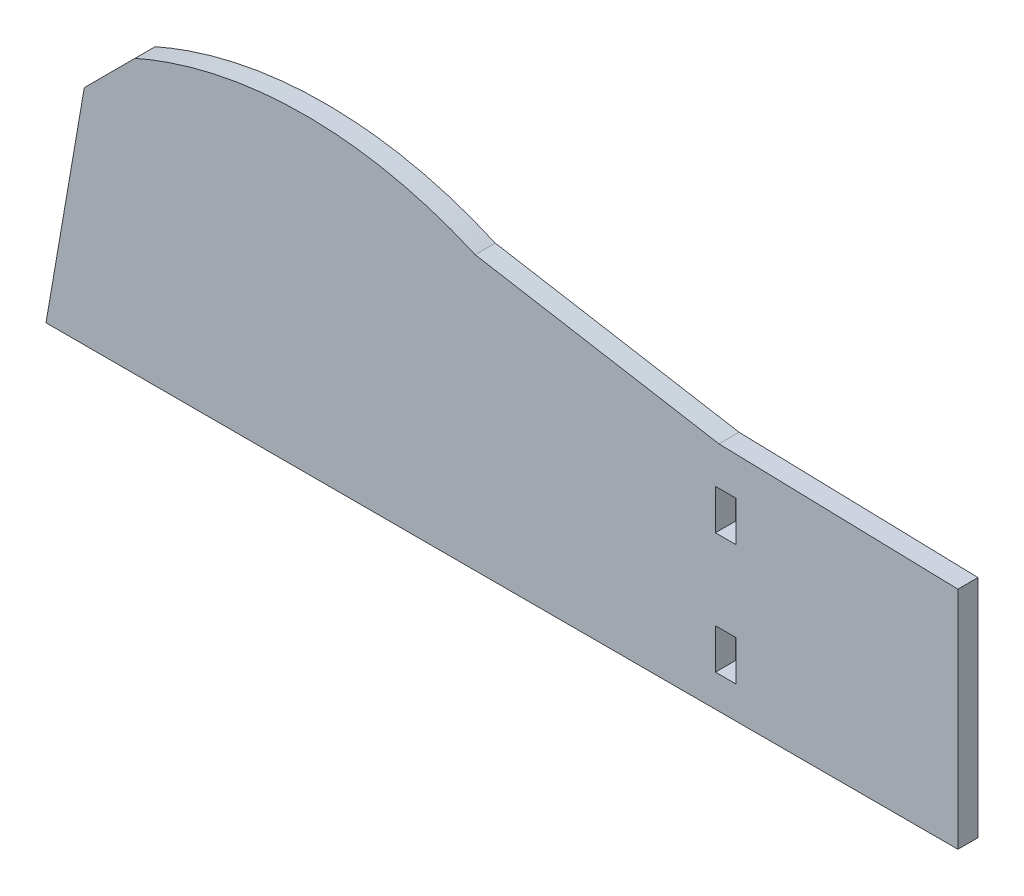
ISO-10303-21;
HEADER;
FILE_DESCRIPTION(('STEP AP214'),'2;1');
FILE_NAME('part.step','',(''),(''),'','','');
FILE_SCHEMA(('AUTOMOTIVE_DESIGN { 1 0 10303 214 1 1 1 1 }'));
ENDSEC;
DATA;
#1=APPLICATION_CONTEXT('core data for automotive mechanical design processes');
#2=APPLICATION_PROTOCOL_DEFINITION('international standard','automotive_design',2000,#1);
#3=PRODUCT_CONTEXT('',#1,'mechanical');
#4=PRODUCT('Part','Part','',(#3));
#5=PRODUCT_RELATED_PRODUCT_CATEGORY('part','',(#4));
#6=PRODUCT_DEFINITION_FORMATION('','',#4);
#7=PRODUCT_DEFINITION_CONTEXT('part definition',#1,'design');
#8=PRODUCT_DEFINITION('design','',#6,#7);
#9=PRODUCT_DEFINITION_SHAPE('','',#8);
#10=(LENGTH_UNIT() NAMED_UNIT(*) SI_UNIT(.MILLI.,.METRE.));
#11=(NAMED_UNIT(*) PLANE_ANGLE_UNIT() SI_UNIT($,.RADIAN.));
#12=(NAMED_UNIT(*) SI_UNIT($,.STERADIAN.) SOLID_ANGLE_UNIT());
#13=UNCERTAINTY_MEASURE_WITH_UNIT(LENGTH_MEASURE(1.E-05),#10,'distance_accuracy_value','');
#14=(GEOMETRIC_REPRESENTATION_CONTEXT(3) GLOBAL_UNCERTAINTY_ASSIGNED_CONTEXT((#13)) GLOBAL_UNIT_ASSIGNED_CONTEXT((#10,
#11,#12)) REPRESENTATION_CONTEXT('',''));
#15=CARTESIAN_POINT('',(0.,0.,0.));
#16=DIRECTION('',(0.,0.,1.));
#17=DIRECTION('',(1.,0.,0.));
#18=AXIS2_PLACEMENT_3D('',#15,#16,#17);
#19=CARTESIAN_POINT('',(0.,35.56,3.175));
#20=DIRECTION('',(-1.,0.,0.));
#21=DIRECTION('',(0.,-1.,0.));
#22=AXIS2_PLACEMENT_3D('',#19,#20,#21);
#23=PLANE('',#22);
#24=DIRECTION('',(0.,1.,0.));
#25=VECTOR('',#24,1.);
#26=CARTESIAN_POINT('',(0.,35.56,0.));
#27=LINE('',#26,#25);
#28=CARTESIAN_POINT('',(0.,0.,0.));
#29=VERTEX_POINT('',#28);
#30=CARTESIAN_POINT('',(0.,35.56,0.));
#31=VERTEX_POINT('',#30);
#32=EDGE_CURVE('E201',#29,#31,#27,.T.);
#33=ORIENTED_EDGE('',*,*,#32,.T.);
#34=DIRECTION('',(0.,0.,-1.));
#35=VECTOR('',#34,1.);
#36=CARTESIAN_POINT('',(0.,35.56,3.175));
#37=LINE('',#36,#35);
#38=CARTESIAN_POINT('',(0.,35.56,3.175));
#39=VERTEX_POINT('',#38);
#40=EDGE_CURVE('E11',#39,#31,#37,.T.);
#41=ORIENTED_EDGE('',*,*,#40,.F.);
#42=DIRECTION('',(0.,1.,0.));
#43=VECTOR('',#42,1.);
#44=CARTESIAN_POINT('',(0.,35.56,3.175));
#45=LINE('',#44,#43);
#46=CARTESIAN_POINT('',(0.,0.,3.175));
#47=VERTEX_POINT('',#46);
#48=EDGE_CURVE('E208',#47,#39,#45,.T.);
#49=ORIENTED_EDGE('',*,*,#48,.F.);
#50=DIRECTION('',(0.,0.,-1.));
#51=VECTOR('',#50,1.);
#52=CARTESIAN_POINT('',(0.,0.,3.175));
#53=LINE('',#52,#51);
#54=EDGE_CURVE('E275',#47,#29,#53,.T.);
#55=ORIENTED_EDGE('',*,*,#54,.T.);
#56=EDGE_LOOP('',(#33,#41,#49,#55));
#57=FACE_BOUND('',#56,.T.);
#58=ADVANCED_FACE('F33',(#57),#23,.F.);
#59=CARTESIAN_POINT('',(-37.7133554514035,36.5669249604453,3.175));
#60=DIRECTION('',(-0.0266899150769853,-0.999643760763395,0.));
#61=DIRECTION('',(0.999643760763395,-0.0266899150769853,0.));
#62=AXIS2_PLACEMENT_3D('',#59,#60,#61);
#63=PLANE('',#62);
#64=DIRECTION('',(-0.999643760763395,0.0266899150769853,0.));
#65=VECTOR('',#64,1.);
#66=CARTESIAN_POINT('',(-37.7133554514035,36.5669249604453,0.));
#67=LINE('',#66,#65);
#68=CARTESIAN_POINT('',(-37.7133554514035,36.5669249604453,0.));
#69=VERTEX_POINT('',#68);
#70=EDGE_CURVE('E245',#31,#69,#67,.T.);
#71=ORIENTED_EDGE('',*,*,#70,.T.);
#72=DIRECTION('',(0.,0.,-1.));
#73=VECTOR('',#72,1.);
#74=CARTESIAN_POINT('',(-37.7133554514035,36.5669249604453,3.175));
#75=LINE('',#74,#73);
#76=CARTESIAN_POINT('',(-37.7133554514035,36.5669249604453,3.175));
#77=VERTEX_POINT('',#76);
#78=EDGE_CURVE('E40',#77,#69,#75,.T.);
#79=ORIENTED_EDGE('',*,*,#78,.F.);
#80=DIRECTION('',(-0.999643760763395,0.0266899150769853,0.));
#81=VECTOR('',#80,1.);
#82=CARTESIAN_POINT('',(-37.7133554514035,36.5669249604453,3.175));
#83=LINE('',#82,#81);
#84=EDGE_CURVE('E211',#39,#77,#83,.T.);
#85=ORIENTED_EDGE('',*,*,#84,.F.);
#86=ORIENTED_EDGE('',*,*,#40,.T.);
#87=EDGE_LOOP('',(#71,#79,#85,#86));
#88=FACE_BOUND('',#87,.T.);
#89=ADVANCED_FACE('F236',(#88),#63,.F.);
#90=CARTESIAN_POINT('',(-76.2,43.18,3.175));
#91=DIRECTION('',(-0.169346021402063,-0.985556657445574,0.));
#92=DIRECTION('',(0.985556657445574,-0.169346021402064,0.));
#93=AXIS2_PLACEMENT_3D('',#90,#91,#92);
#94=PLANE('',#93);
#95=DIRECTION('',(-0.985556657445574,0.169346021402063,0.));
#96=VECTOR('',#95,1.);
#97=CARTESIAN_POINT('',(-76.2,43.18,0.));
#98=LINE('',#97,#96);
#99=CARTESIAN_POINT('',(-76.2,43.18,0.));
#100=VERTEX_POINT('',#99);
#101=EDGE_CURVE('E253',#69,#100,#98,.T.);
#102=ORIENTED_EDGE('',*,*,#101,.T.);
#103=DIRECTION('',(0.,0.,-1.));
#104=VECTOR('',#103,1.);
#105=CARTESIAN_POINT('',(-76.2,43.18,3.175));
#106=LINE('',#105,#104);
#107=CARTESIAN_POINT('',(-76.2,43.18,3.175));
#108=VERTEX_POINT('',#107);
#109=EDGE_CURVE('E257',#108,#100,#106,.T.);
#110=ORIENTED_EDGE('',*,*,#109,.F.);
#111=DIRECTION('',(-0.985556657445574,0.169346021402063,0.));
#112=VECTOR('',#111,1.);
#113=CARTESIAN_POINT('',(-76.2,43.18,3.175));
#114=LINE('',#113,#112);
#115=EDGE_CURVE('E214',#77,#108,#114,.T.);
#116=ORIENTED_EDGE('',*,*,#115,.F.);
#117=ORIENTED_EDGE('',*,*,#78,.T.);
#118=EDGE_LOOP('',(#102,#110,#116,#117));
#119=FACE_BOUND('',#118,.T.);
#120=ADVANCED_FACE('F232',(#119),#94,.F.);
#121=CARTESIAN_POINT('',(-76.2,43.18,3.175));
#122=CARTESIAN_POINT('',(-79.7260587717616,44.7408164594273,3.175));
#123=CARTESIAN_POINT('',(-86.4115426594005,47.0274632286595,3.175));
#124=CARTESIAN_POINT('',(-95.5225011340299,48.5934208601401,3.175));
#125=CARTESIAN_POINT('',(-103.247996655704,48.9721366914077,3.175));
#126=CARTESIAN_POINT('',(-114.625709488405,48.3623172431234,3.175));
#127=CARTESIAN_POINT('',(-123.63290929377,45.9559869162211,3.175));
#128=CARTESIAN_POINT('',(-129.892439684021,43.18,3.175));
#129=B_SPLINE_CURVE_WITH_KNOTS('',3,(#121,#122,#123,#124,#125,#126,#127,#128),.UNSPECIFIED.,.F.,
.F.,(4,1,1,1,1,4),(0.,0.209285503080936,0.382391471797348,0.500093059641283,0.628767459079232,
1.),.UNSPECIFIED.);
#130=DIRECTION('',(0.,0.,-1.));
#131=VECTOR('',#130,1.);
#132=SURFACE_OF_LINEAR_EXTRUSION('',#129,#131);
#133=CARTESIAN_POINT('',(-76.2,43.18,0.));
#134=CARTESIAN_POINT('',(-79.7260587717616,44.7408164594273,0.));
#135=CARTESIAN_POINT('',(-86.4115426594005,47.0274632286595,0.));
#136=CARTESIAN_POINT('',(-95.5225011340299,48.5934208601401,0.));
#137=CARTESIAN_POINT('',(-103.247996655704,48.9721366914077,0.));
#138=CARTESIAN_POINT('',(-114.625709488405,48.3623172431234,0.));
#139=CARTESIAN_POINT('',(-123.63290929377,45.9559869162211,0.));
#140=CARTESIAN_POINT('',(-129.892439684021,43.18,0.));
#141=B_SPLINE_CURVE_WITH_KNOTS('',3,(#133,#134,#135,#136,#137,#138,#139,#140),.UNSPECIFIED.,.F.,
.F.,(4,1,1,1,1,4),(0.,0.209285503080936,0.382391471797348,0.500093059641283,0.628767459079232,
1.),.UNSPECIFIED.);
#142=CARTESIAN_POINT('',(-129.892439684021,43.18,0.));
#143=VERTEX_POINT('',#142);
#144=EDGE_CURVE('E260',#100,#143,#141,.T.);
#145=ORIENTED_EDGE('',*,*,#144,.T.);
#146=DIRECTION('',(0.,0.,-1.));
#147=VECTOR('',#146,1.);
#148=CARTESIAN_POINT('',(-129.892439684021,43.18,3.175));
#149=LINE('',#148,#147);
#150=CARTESIAN_POINT('',(-129.892439684021,43.18,3.175));
#151=VERTEX_POINT('',#150);
#152=EDGE_CURVE('E285',#151,#143,#149,.T.);
#153=ORIENTED_EDGE('',*,*,#152,.F.);
#154=EDGE_CURVE('E216',#108,#151,#129,.T.);
#155=ORIENTED_EDGE('',*,*,#154,.F.);
#156=ORIENTED_EDGE('',*,*,#109,.T.);
#157=EDGE_LOOP('',(#145,#153,#155,#156));
#158=FACE_BOUND('',#157,.T.);
#159=ADVANCED_FACE('F227',(#158),#132,.F.);
#160=CARTESIAN_POINT('',(-129.892439684021,43.18,3.175));
#161=DIRECTION('',(0.707106781186548,-0.707106781186547,0.));
#162=DIRECTION('',(0.707106781186547,0.707106781186548,0.));
#163=AXIS2_PLACEMENT_3D('',#160,#161,#162);
#164=PLANE('',#163);
#165=DIRECTION('',(-0.707106781186547,-0.707106781186548,0.));
#166=VECTOR('',#165,1.);
#167=CARTESIAN_POINT('',(-129.892439684021,43.18,0.));
#168=LINE('',#167,#166);
#169=CARTESIAN_POINT('',(-137.89580793114,35.1766317528806,0.));
#170=VERTEX_POINT('',#169);
#171=EDGE_CURVE('E262',#143,#170,#168,.T.);
#172=ORIENTED_EDGE('',*,*,#171,.T.);
#173=DIRECTION('',(0.,0.,-1.));
#174=VECTOR('',#173,1.);
#175=CARTESIAN_POINT('',(-137.89580793114,35.1766317528806,3.175));
#176=LINE('',#175,#174);
#177=CARTESIAN_POINT('',(-137.89580793114,35.1766317528806,3.175));
#178=VERTEX_POINT('',#177);
#179=EDGE_CURVE('E282',#178,#170,#176,.T.);
#180=ORIENTED_EDGE('',*,*,#179,.F.);
#181=DIRECTION('',(-0.707106781186547,-0.707106781186548,0.));
#182=VECTOR('',#181,1.);
#183=CARTESIAN_POINT('',(-129.892439684021,43.18,3.175));
#184=LINE('',#183,#182);
#185=EDGE_CURVE('E221',#151,#178,#184,.T.);
#186=ORIENTED_EDGE('',*,*,#185,.F.);
#187=ORIENTED_EDGE('',*,*,#152,.T.);
#188=EDGE_LOOP('',(#172,#180,#186,#187));
#189=FACE_BOUND('',#188,.T.);
#190=ADVANCED_FACE('F231',(#189),#164,.F.);
#191=CARTESIAN_POINT('',(-137.89580793114,35.1766317528806,3.175));
#192=DIRECTION('',(0.985556657445574,-0.169346021402064,0.));
#193=DIRECTION('',(0.169346021402064,0.985556657445574,0.));
#194=AXIS2_PLACEMENT_3D('',#191,#192,#193);
#195=PLANE('',#194);
#196=DIRECTION('',(-0.169346021402064,-0.985556657445573,0.));
#197=VECTOR('',#196,1.);
#198=CARTESIAN_POINT('',(-137.89580793114,35.1766317528806,0.));
#199=LINE('',#198,#197);
#200=CARTESIAN_POINT('',(-143.940130790382,0.,0.));
#201=VERTEX_POINT('',#200);
#202=EDGE_CURVE('E272',#170,#201,#199,.T.);
#203=ORIENTED_EDGE('',*,*,#202,.T.);
#204=DIRECTION('',(0.,0.,-1.));
#205=VECTOR('',#204,1.);
#206=CARTESIAN_POINT('',(-143.940130790382,0.,3.175));
#207=LINE('',#206,#205);
#208=CARTESIAN_POINT('',(-143.940130790382,0.,3.175));
#209=VERTEX_POINT('',#208);
#210=EDGE_CURVE('E278',#209,#201,#207,.T.);
#211=ORIENTED_EDGE('',*,*,#210,.F.);
#212=DIRECTION('',(-0.169346021402064,-0.985556657445573,0.));
#213=VECTOR('',#212,1.);
#214=CARTESIAN_POINT('',(-137.89580793114,35.1766317528806,3.175));
#215=LINE('',#214,#213);
#216=EDGE_CURVE('E299',#178,#209,#215,.T.);
#217=ORIENTED_EDGE('',*,*,#216,.F.);
#218=ORIENTED_EDGE('',*,*,#179,.T.);
#219=EDGE_LOOP('',(#203,#211,#217,#218));
#220=FACE_BOUND('',#219,.T.);
#221=ADVANCED_FACE('F303',(#220),#195,.F.);
#222=CARTESIAN_POINT('',(0.,0.,3.175));
#223=DIRECTION('',(0.,1.,0.));
#224=DIRECTION('',(0.,0.,1.));
#225=AXIS2_PLACEMENT_3D('',#222,#223,#224);
#226=PLANE('',#225);
#227=DIRECTION('',(1.,0.,0.));
#228=VECTOR('',#227,1.);
#229=CARTESIAN_POINT('',(0.,0.,0.));
#230=LINE('',#229,#228);
#231=EDGE_CURVE('E212',#201,#29,#230,.T.);
#232=ORIENTED_EDGE('',*,*,#231,.T.);
#233=ORIENTED_EDGE('',*,*,#54,.F.);
#234=DIRECTION('',(1.,0.,0.));
#235=VECTOR('',#234,1.);
#236=CARTESIAN_POINT('',(0.,0.,3.175));
#237=LINE('',#236,#235);
#238=EDGE_CURVE('E279',#209,#47,#237,.T.);
#239=ORIENTED_EDGE('',*,*,#238,.F.);
#240=ORIENTED_EDGE('',*,*,#210,.T.);
#241=EDGE_LOOP('',(#232,#233,#239,#240));
#242=FACE_BOUND('',#241,.T.);
#243=ADVANCED_FACE('F306',(#242),#226,.F.);
#244=CARTESIAN_POINT('',(-103.041077545763,48.8559442422891,3.175));
#245=DIRECTION('',(0.,0.,1.));
#246=DIRECTION('',(1.,0.,0.));
#247=AXIS2_PLACEMENT_3D('',#244,#245,#246);
#248=PLANE('',#247);
#249=DIRECTION('',(0.,1.,0.));
#250=VECTOR('',#249,1.);
#251=CARTESIAN_POINT('',(-35.052,11.43,3.175));
#252=LINE('',#251,#250);
#253=CARTESIAN_POINT('',(-35.052,5.07999999999999,3.175));
#254=VERTEX_POINT('',#253);
#255=CARTESIAN_POINT('',(-35.052,11.43,3.175));
#256=VERTEX_POINT('',#255);
#257=EDGE_CURVE('E47',#254,#256,#252,.T.);
#258=ORIENTED_EDGE('',*,*,#257,.F.);
#259=DIRECTION('',(1.,0.,0.));
#260=VECTOR('',#259,1.);
#261=CARTESIAN_POINT('',(-38.2778,5.07999999999999,3.175));
#262=LINE('',#261,#260);
#263=CARTESIAN_POINT('',(-38.2778,5.07999999999999,3.175));
#264=VERTEX_POINT('',#263);
#265=EDGE_CURVE('E157',#264,#254,#262,.T.);
#266=ORIENTED_EDGE('',*,*,#265,.F.);
#267=DIRECTION('',(0.,-1.,0.));
#268=VECTOR('',#267,1.);
#269=CARTESIAN_POINT('',(-38.2778,11.43,3.175));
#270=LINE('',#269,#268);
#271=CARTESIAN_POINT('',(-38.2778,11.43,3.175));
#272=VERTEX_POINT('',#271);
#273=EDGE_CURVE('E160',#272,#264,#270,.T.);
#274=ORIENTED_EDGE('',*,*,#273,.F.);
#275=DIRECTION('',(-1.,0.,0.));
#276=VECTOR('',#275,1.);
#277=CARTESIAN_POINT('',(-38.2778,11.43,3.175));
#278=LINE('',#277,#276);
#279=EDGE_CURVE('E166',#256,#272,#278,.T.);
#280=ORIENTED_EDGE('',*,*,#279,.F.);
#281=EDGE_LOOP('',(#258,#266,#274,#280));
#282=FACE_BOUND('',#281,.T.);
#283=DIRECTION('',(0.,1.,0.));
#284=VECTOR('',#283,1.);
#285=CARTESIAN_POINT('',(-35.052,30.48,3.175));
#286=LINE('',#285,#284);
#287=CARTESIAN_POINT('',(-35.052,24.13,3.175));
#288=VERTEX_POINT('',#287);
#289=CARTESIAN_POINT('',(-35.052,30.48,3.175));
#290=VERTEX_POINT('',#289);
#291=EDGE_CURVE('E172',#288,#290,#286,.T.);
#292=ORIENTED_EDGE('',*,*,#291,.F.);
#293=DIRECTION('',(1.,0.,0.));
#294=VECTOR('',#293,1.);
#295=CARTESIAN_POINT('',(-38.2778,24.13,3.175));
#296=LINE('',#295,#294);
#297=CARTESIAN_POINT('',(-38.2778,24.13,3.175));
#298=VERTEX_POINT('',#297);
#299=EDGE_CURVE('E180',#298,#288,#296,.T.);
#300=ORIENTED_EDGE('',*,*,#299,.F.);
#301=DIRECTION('',(0.,-1.,0.));
#302=VECTOR('',#301,1.);
#303=CARTESIAN_POINT('',(-38.2778,30.48,3.175));
#304=LINE('',#303,#302);
#305=CARTESIAN_POINT('',(-38.2778,30.48,3.175));
#306=VERTEX_POINT('',#305);
#307=EDGE_CURVE('E194',#306,#298,#304,.T.);
#308=ORIENTED_EDGE('',*,*,#307,.F.);
#309=DIRECTION('',(-1.,0.,0.));
#310=VECTOR('',#309,1.);
#311=CARTESIAN_POINT('',(-38.2778,30.48,3.175));
#312=LINE('',#311,#310);
#313=EDGE_CURVE('E191',#290,#306,#312,.T.);
#314=ORIENTED_EDGE('',*,*,#313,.F.);
#315=EDGE_LOOP('',(#292,#300,#308,#314));
#316=FACE_BOUND('',#315,.T.);
#317=ORIENTED_EDGE('',*,*,#48,.T.);
#318=ORIENTED_EDGE('',*,*,#84,.T.);
#319=ORIENTED_EDGE('',*,*,#115,.T.);
#320=ORIENTED_EDGE('',*,*,#154,.T.);
#321=ORIENTED_EDGE('',*,*,#185,.T.);
#322=ORIENTED_EDGE('',*,*,#216,.T.);
#323=ORIENTED_EDGE('',*,*,#238,.T.);
#324=EDGE_LOOP('',(#317,#318,#319,#320,#321,#322,#323));
#325=FACE_BOUND('',#324,.T.);
#326=ADVANCED_FACE('F292',(#282,#316,#325),#248,.T.);
#327=CARTESIAN_POINT('',(-103.041077545763,48.8559442422891,0.));
#328=DIRECTION('',(0.,0.,1.));
#329=DIRECTION('',(1.,0.,0.));
#330=AXIS2_PLACEMENT_3D('',#327,#328,#329);
#331=PLANE('',#330);
#332=DIRECTION('',(1.,0.,0.));
#333=VECTOR('',#332,1.);
#334=CARTESIAN_POINT('',(-38.2778,5.07999999999999,0.));
#335=LINE('',#334,#333);
#336=CARTESIAN_POINT('',(-38.2778,5.07999999999999,0.));
#337=VERTEX_POINT('',#336);
#338=CARTESIAN_POINT('',(-35.052,5.07999999999999,0.));
#339=VERTEX_POINT('',#338);
#340=EDGE_CURVE('E147',#337,#339,#335,.T.);
#341=ORIENTED_EDGE('',*,*,#340,.T.);
#342=DIRECTION('',(0.,1.,0.));
#343=VECTOR('',#342,1.);
#344=CARTESIAN_POINT('',(-35.052,11.43,0.));
#345=LINE('',#344,#343);
#346=CARTESIAN_POINT('',(-35.052,11.43,0.));
#347=VERTEX_POINT('',#346);
#348=EDGE_CURVE('E141',#339,#347,#345,.T.);
#349=ORIENTED_EDGE('',*,*,#348,.T.);
#350=DIRECTION('',(-1.,0.,0.));
#351=VECTOR('',#350,1.);
#352=CARTESIAN_POINT('',(-38.2778,11.43,0.));
#353=LINE('',#352,#351);
#354=CARTESIAN_POINT('',(-38.2778,11.43,0.));
#355=VERTEX_POINT('',#354);
#356=EDGE_CURVE('E150',#347,#355,#353,.T.);
#357=ORIENTED_EDGE('',*,*,#356,.T.);
#358=DIRECTION('',(0.,-1.,0.));
#359=VECTOR('',#358,1.);
#360=CARTESIAN_POINT('',(-38.2778,11.43,0.));
#361=LINE('',#360,#359);
#362=EDGE_CURVE('E55',#355,#337,#361,.T.);
#363=ORIENTED_EDGE('',*,*,#362,.T.);
#364=EDGE_LOOP('',(#341,#349,#357,#363));
#365=FACE_BOUND('',#364,.T.);
#366=DIRECTION('',(1.,0.,0.));
#367=VECTOR('',#366,1.);
#368=CARTESIAN_POINT('',(-38.2778,24.13,0.));
#369=LINE('',#368,#367);
#370=CARTESIAN_POINT('',(-38.2778,24.13,0.));
#371=VERTEX_POINT('',#370);
#372=CARTESIAN_POINT('',(-35.052,24.13,0.));
#373=VERTEX_POINT('',#372);
#374=EDGE_CURVE('E186',#371,#373,#369,.T.);
#375=ORIENTED_EDGE('',*,*,#374,.T.);
#376=DIRECTION('',(0.,1.,0.));
#377=VECTOR('',#376,1.);
#378=CARTESIAN_POINT('',(-35.052,30.48,0.));
#379=LINE('',#378,#377);
#380=CARTESIAN_POINT('',(-35.052,30.48,0.));
#381=VERTEX_POINT('',#380);
#382=EDGE_CURVE('E176',#373,#381,#379,.T.);
#383=ORIENTED_EDGE('',*,*,#382,.T.);
#384=DIRECTION('',(-1.,0.,0.));
#385=VECTOR('',#384,1.);
#386=CARTESIAN_POINT('',(-38.2778,30.48,0.));
#387=LINE('',#386,#385);
#388=CARTESIAN_POINT('',(-38.2778,30.48,0.));
#389=VERTEX_POINT('',#388);
#390=EDGE_CURVE('E179',#381,#389,#387,.T.);
#391=ORIENTED_EDGE('',*,*,#390,.T.);
#392=DIRECTION('',(0.,-1.,0.));
#393=VECTOR('',#392,1.);
#394=CARTESIAN_POINT('',(-38.2778,30.48,0.));
#395=LINE('',#394,#393);
#396=EDGE_CURVE('E183',#389,#371,#395,.T.);
#397=ORIENTED_EDGE('',*,*,#396,.T.);
#398=EDGE_LOOP('',(#375,#383,#391,#397));
#399=FACE_BOUND('',#398,.T.);
#400=ORIENTED_EDGE('',*,*,#32,.F.);
#401=ORIENTED_EDGE('',*,*,#231,.F.);
#402=ORIENTED_EDGE('',*,*,#202,.F.);
#403=ORIENTED_EDGE('',*,*,#171,.F.);
#404=ORIENTED_EDGE('',*,*,#144,.F.);
#405=ORIENTED_EDGE('',*,*,#101,.F.);
#406=ORIENTED_EDGE('',*,*,#70,.F.);
#407=EDGE_LOOP('',(#400,#401,#402,#403,#404,#405,#406));
#408=FACE_BOUND('',#407,.T.);
#409=ADVANCED_FACE('F154',(#365,#399,#408),#331,.F.);
#410=CARTESIAN_POINT('',(-35.052,30.48,0.));
#411=DIRECTION('',(1.,0.,0.));
#412=DIRECTION('',(0.,0.,-1.));
#413=AXIS2_PLACEMENT_3D('',#410,#411,#412);
#414=PLANE('',#413);
#415=ORIENTED_EDGE('',*,*,#291,.T.);
#416=DIRECTION('',(0.,0.,1.));
#417=VECTOR('',#416,1.);
#418=CARTESIAN_POINT('',(-35.052,30.48,0.));
#419=LINE('',#418,#417);
#420=EDGE_CURVE('E189',#381,#290,#419,.T.);
#421=ORIENTED_EDGE('',*,*,#420,.F.);
#422=ORIENTED_EDGE('',*,*,#382,.F.);
#423=DIRECTION('',(0.,0.,1.));
#424=VECTOR('',#423,1.);
#425=CARTESIAN_POINT('',(-35.052,24.13,0.));
#426=LINE('',#425,#424);
#427=EDGE_CURVE('E199',#373,#288,#426,.T.);
#428=ORIENTED_EDGE('',*,*,#427,.T.);
#429=EDGE_LOOP('',(#415,#421,#422,#428));
#430=FACE_BOUND('',#429,.T.);
#431=ADVANCED_FACE('F319',(#430),#414,.F.);
#432=CARTESIAN_POINT('',(-38.2778,24.13,0.));
#433=DIRECTION('',(0.,-1.,0.));
#434=DIRECTION('',(1.,0.,0.));
#435=AXIS2_PLACEMENT_3D('',#432,#433,#434);
#436=PLANE('',#435);
#437=ORIENTED_EDGE('',*,*,#299,.T.);
#438=ORIENTED_EDGE('',*,*,#427,.F.);
#439=ORIENTED_EDGE('',*,*,#374,.F.);
#440=DIRECTION('',(0.,0.,1.));
#441=VECTOR('',#440,1.);
#442=CARTESIAN_POINT('',(-38.2778,24.13,0.));
#443=LINE('',#442,#441);
#444=EDGE_CURVE('E202',#371,#298,#443,.T.);
#445=ORIENTED_EDGE('',*,*,#444,.T.);
#446=EDGE_LOOP('',(#437,#438,#439,#445));
#447=FACE_BOUND('',#446,.T.);
#448=ADVANCED_FACE('F325',(#447),#436,.F.);
#449=CARTESIAN_POINT('',(-38.2778,30.48,0.));
#450=DIRECTION('',(-1.,0.,0.));
#451=DIRECTION('',(0.,-1.,0.));
#452=AXIS2_PLACEMENT_3D('',#449,#450,#451);
#453=PLANE('',#452);
#454=ORIENTED_EDGE('',*,*,#307,.T.);
#455=ORIENTED_EDGE('',*,*,#444,.F.);
#456=ORIENTED_EDGE('',*,*,#396,.F.);
#457=DIRECTION('',(0.,0.,1.));
#458=VECTOR('',#457,1.);
#459=CARTESIAN_POINT('',(-38.2778,30.48,0.));
#460=LINE('',#459,#458);
#461=EDGE_CURVE('E204',#389,#306,#460,.T.);
#462=ORIENTED_EDGE('',*,*,#461,.T.);
#463=EDGE_LOOP('',(#454,#455,#456,#462));
#464=FACE_BOUND('',#463,.T.);
#465=ADVANCED_FACE('F330',(#464),#453,.F.);
#466=CARTESIAN_POINT('',(-38.2778,30.48,0.));
#467=DIRECTION('',(0.,1.,0.));
#468=DIRECTION('',(0.,0.,1.));
#469=AXIS2_PLACEMENT_3D('',#466,#467,#468);
#470=PLANE('',#469);
#471=ORIENTED_EDGE('',*,*,#313,.T.);
#472=ORIENTED_EDGE('',*,*,#461,.F.);
#473=ORIENTED_EDGE('',*,*,#390,.F.);
#474=ORIENTED_EDGE('',*,*,#420,.T.);
#475=EDGE_LOOP('',(#471,#472,#473,#474));
#476=FACE_BOUND('',#475,.T.);
#477=ADVANCED_FACE('F327',(#476),#470,.F.);
#478=CARTESIAN_POINT('',(-35.052,11.43,0.));
#479=DIRECTION('',(1.,0.,0.));
#480=DIRECTION('',(0.,0.,-1.));
#481=AXIS2_PLACEMENT_3D('',#478,#479,#480);
#482=PLANE('',#481);
#483=ORIENTED_EDGE('',*,*,#257,.T.);
#484=DIRECTION('',(0.,0.,1.));
#485=VECTOR('',#484,1.);
#486=CARTESIAN_POINT('',(-35.052,11.43,0.));
#487=LINE('',#486,#485);
#488=EDGE_CURVE('E137',#347,#256,#487,.T.);
#489=ORIENTED_EDGE('',*,*,#488,.F.);
#490=ORIENTED_EDGE('',*,*,#348,.F.);
#491=DIRECTION('',(0.,0.,1.));
#492=VECTOR('',#491,1.);
#493=CARTESIAN_POINT('',(-35.052,5.07999999999999,0.));
#494=LINE('',#493,#492);
#495=EDGE_CURVE('E170',#339,#254,#494,.T.);
#496=ORIENTED_EDGE('',*,*,#495,.T.);
#497=EDGE_LOOP('',(#483,#489,#490,#496));
#498=FACE_BOUND('',#497,.T.);
#499=ADVANCED_FACE('F139',(#498),#482,.F.);
#500=CARTESIAN_POINT('',(-38.2778,5.07999999999999,0.));
#501=DIRECTION('',(0.,-1.,0.));
#502=DIRECTION('',(0.,0.,-1.));
#503=AXIS2_PLACEMENT_3D('',#500,#501,#502);
#504=PLANE('',#503);
#505=ORIENTED_EDGE('',*,*,#265,.T.);
#506=ORIENTED_EDGE('',*,*,#495,.F.);
#507=ORIENTED_EDGE('',*,*,#340,.F.);
#508=DIRECTION('',(0.,0.,1.));
#509=VECTOR('',#508,1.);
#510=CARTESIAN_POINT('',(-38.2778,5.07999999999999,0.));
#511=LINE('',#510,#509);
#512=EDGE_CURVE('E173',#337,#264,#511,.T.);
#513=ORIENTED_EDGE('',*,*,#512,.T.);
#514=EDGE_LOOP('',(#505,#506,#507,#513));
#515=FACE_BOUND('',#514,.T.);
#516=ADVANCED_FACE('F340',(#515),#504,.F.);
#517=CARTESIAN_POINT('',(-38.2778,11.43,0.));
#518=DIRECTION('',(-1.,0.,0.));
#519=DIRECTION('',(0.,0.,1.));
#520=AXIS2_PLACEMENT_3D('',#517,#518,#519);
#521=PLANE('',#520);
#522=ORIENTED_EDGE('',*,*,#273,.T.);
#523=ORIENTED_EDGE('',*,*,#512,.F.);
#524=ORIENTED_EDGE('',*,*,#362,.F.);
#525=DIRECTION('',(0.,0.,1.));
#526=VECTOR('',#525,1.);
#527=CARTESIAN_POINT('',(-38.2778,11.43,0.));
#528=LINE('',#527,#526);
#529=EDGE_CURVE('E146',#355,#272,#528,.T.);
#530=ORIENTED_EDGE('',*,*,#529,.T.);
#531=EDGE_LOOP('',(#522,#523,#524,#530));
#532=FACE_BOUND('',#531,.T.);
#533=ADVANCED_FACE('F343',(#532),#521,.F.);
#534=CARTESIAN_POINT('',(-38.2778,11.43,0.));
#535=DIRECTION('',(0.,1.,0.));
#536=DIRECTION('',(-1.,0.,0.));
#537=AXIS2_PLACEMENT_3D('',#534,#535,#536);
#538=PLANE('',#537);
#539=ORIENTED_EDGE('',*,*,#279,.T.);
#540=ORIENTED_EDGE('',*,*,#529,.F.);
#541=ORIENTED_EDGE('',*,*,#356,.F.);
#542=ORIENTED_EDGE('',*,*,#488,.T.);
#543=EDGE_LOOP('',(#539,#540,#541,#542));
#544=FACE_BOUND('',#543,.T.);
#545=ADVANCED_FACE('F151',(#544),#538,.F.);
#546=CLOSED_SHELL('',(#58,#89,#120,#159,#190,#221,#243,#326,#409,#431,#448,#465,#477,#499,#516,
#533,#545));
#547=MANIFOLD_SOLID_BREP('B2',#546);
#548=ADVANCED_BREP_SHAPE_REPRESENTATION('',(#18,#547),#14);
#549=SHAPE_DEFINITION_REPRESENTATION(#9,#548);
ENDSEC;
END-ISO-10303-21;
